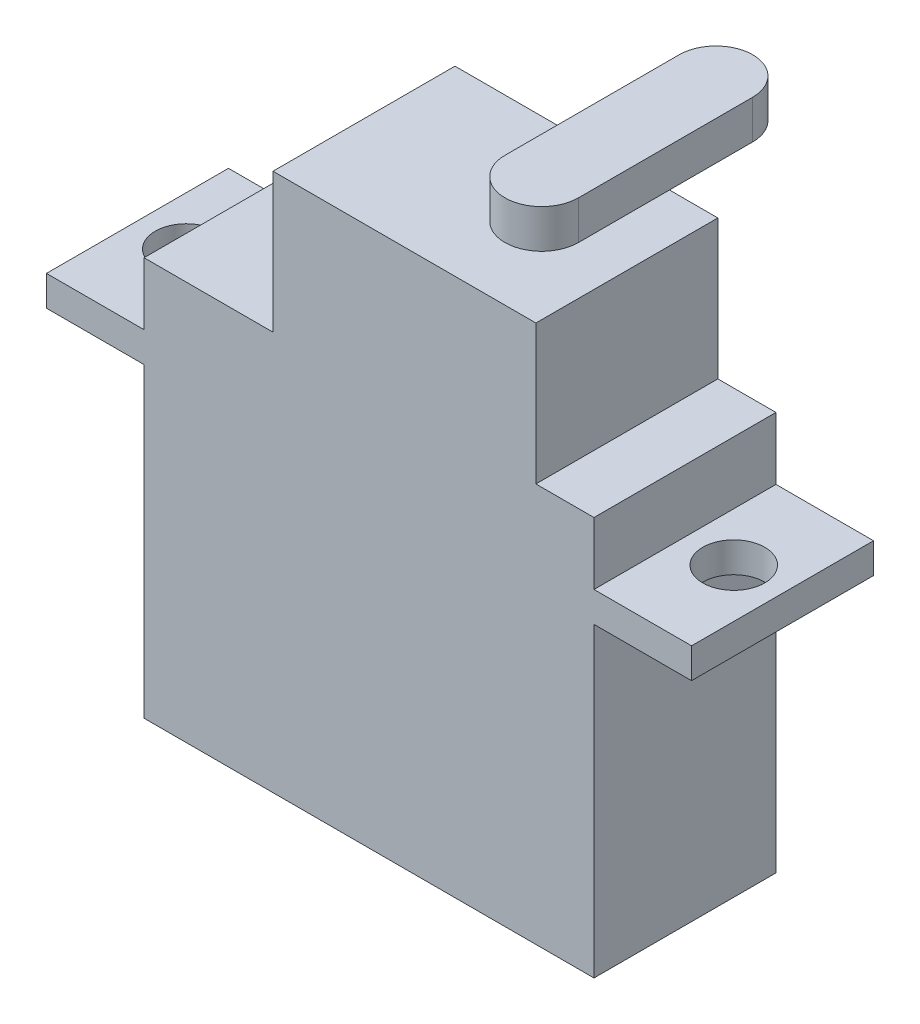
ISO-10303-21;
HEADER;
FILE_DESCRIPTION(('STEP AP214'),'2;1');
FILE_NAME('part.step','',(''),(''),'','','');
FILE_SCHEMA(('AUTOMOTIVE_DESIGN { 1 0 10303 214 1 1 1 1 }'));
ENDSEC;
DATA;
#1=APPLICATION_CONTEXT('core data for automotive mechanical design processes');
#2=APPLICATION_PROTOCOL_DEFINITION('international standard','automotive_design',2000,#1);
#3=PRODUCT_CONTEXT('',#1,'mechanical');
#4=PRODUCT('Part','Part','',(#3));
#5=PRODUCT_RELATED_PRODUCT_CATEGORY('part','',(#4));
#6=PRODUCT_DEFINITION_FORMATION('','',#4);
#7=PRODUCT_DEFINITION_CONTEXT('part definition',#1,'design');
#8=PRODUCT_DEFINITION('design','',#6,#7);
#9=PRODUCT_DEFINITION_SHAPE('','',#8);
#10=(LENGTH_UNIT() NAMED_UNIT(*) SI_UNIT(.MILLI.,.METRE.));
#11=(NAMED_UNIT(*) PLANE_ANGLE_UNIT() SI_UNIT($,.RADIAN.));
#12=(NAMED_UNIT(*) SI_UNIT($,.STERADIAN.) SOLID_ANGLE_UNIT());
#13=UNCERTAINTY_MEASURE_WITH_UNIT(LENGTH_MEASURE(1.E-05),#10,'distance_accuracy_value','');
#14=(GEOMETRIC_REPRESENTATION_CONTEXT(3) GLOBAL_UNCERTAINTY_ASSIGNED_CONTEXT((#13)) GLOBAL_UNIT_ASSIGNED_CONTEXT((#10,
#11,#12)) REPRESENTATION_CONTEXT('',''));
#15=CARTESIAN_POINT('',(0.,0.,0.));
#16=DIRECTION('',(0.,0.,1.));
#17=DIRECTION('',(1.,0.,0.));
#18=AXIS2_PLACEMENT_3D('',#15,#16,#17);
#19=CARTESIAN_POINT('',(0.,26.162,0.));
#20=DIRECTION('',(0.,1.,0.));
#21=DIRECTION('',(0.,0.,1.));
#22=AXIS2_PLACEMENT_3D('',#19,#20,#21);
#23=PLANE('',#22);
#24=DIRECTION('',(0.,0.,1.));
#25=VECTOR('',#24,1.);
#26=CARTESIAN_POINT('',(8.4582,26.162,0.));
#27=LINE('',#26,#25);
#28=CARTESIAN_POINT('',(8.4582,26.162,0.));
#29=VERTEX_POINT('',#28);
#30=CARTESIAN_POINT('',(8.4582,26.162,11.938));
#31=VERTEX_POINT('',#30);
#32=EDGE_CURVE('E197',#29,#31,#27,.T.);
#33=ORIENTED_EDGE('',*,*,#32,.F.);
#34=DIRECTION('',(-1.,0.,0.));
#35=VECTOR('',#34,1.);
#36=CARTESIAN_POINT('',(0.,26.162,0.));
#37=LINE('',#36,#35);
#38=CARTESIAN_POINT('',(0.,26.162,0.));
#39=VERTEX_POINT('',#38);
#40=EDGE_CURVE('E303',#29,#39,#37,.T.);
#41=ORIENTED_EDGE('',*,*,#40,.T.);
#42=DIRECTION('',(0.,0.,1.));
#43=VECTOR('',#42,1.);
#44=CARTESIAN_POINT('',(0.,26.162,0.));
#45=LINE('',#44,#43);
#46=CARTESIAN_POINT('',(0.,26.162,11.938));
#47=VERTEX_POINT('',#46);
#48=EDGE_CURVE('E294',#39,#47,#45,.T.);
#49=ORIENTED_EDGE('',*,*,#48,.T.);
#50=DIRECTION('',(1.,0.,0.));
#51=VECTOR('',#50,1.);
#52=CARTESIAN_POINT('',(0.,26.162,11.938));
#53=LINE('',#52,#51);
#54=EDGE_CURVE('E299',#47,#31,#53,.T.);
#55=ORIENTED_EDGE('',*,*,#54,.T.);
#56=EDGE_LOOP('',(#33,#41,#49,#55));
#57=FACE_BOUND('',#56,.T.);
#58=ADVANCED_FACE('F33',(#57),#23,.T.);
#59=CARTESIAN_POINT('',(0.,26.162,0.));
#60=DIRECTION('',(1.,0.,0.));
#61=DIRECTION('',(0.,0.,-1.));
#62=AXIS2_PLACEMENT_3D('',#59,#60,#61);
#63=PLANE('',#62);
#64=DIRECTION('',(0.,-1.,0.));
#65=VECTOR('',#64,1.);
#66=CARTESIAN_POINT('',(0.,26.162,11.938));
#67=LINE('',#66,#65);
#68=CARTESIAN_POINT('',(0.,20.0914,11.938));
#69=VERTEX_POINT('',#68);
#70=CARTESIAN_POINT('',(0.,0.,11.938));
#71=VERTEX_POINT('',#70);
#72=EDGE_CURVE('E326',#69,#71,#67,.T.);
#73=ORIENTED_EDGE('',*,*,#72,.F.);
#74=DIRECTION('',(0.,0.,-1.));
#75=VECTOR('',#74,1.);
#76=CARTESIAN_POINT('',(0.,20.0914,11.938));
#77=LINE('',#76,#75);
#78=CARTESIAN_POINT('',(0.,20.0914,0.));
#79=VERTEX_POINT('',#78);
#80=EDGE_CURVE('E245',#69,#79,#77,.T.);
#81=ORIENTED_EDGE('',*,*,#80,.T.);
#82=DIRECTION('',(0.,-1.,0.));
#83=VECTOR('',#82,1.);
#84=CARTESIAN_POINT('',(0.,26.162,0.));
#85=LINE('',#84,#83);
#86=CARTESIAN_POINT('',(0.,0.,0.));
#87=VERTEX_POINT('',#86);
#88=EDGE_CURVE('E306',#79,#87,#85,.T.);
#89=ORIENTED_EDGE('',*,*,#88,.T.);
#90=DIRECTION('',(0.,0.,1.));
#91=VECTOR('',#90,1.);
#92=CARTESIAN_POINT('',(0.,0.,0.));
#93=LINE('',#92,#91);
#94=EDGE_CURVE('E293',#87,#71,#93,.T.);
#95=ORIENTED_EDGE('',*,*,#94,.T.);
#96=EDGE_LOOP('',(#73,#81,#89,#95));
#97=FACE_BOUND('',#96,.T.);
#98=ADVANCED_FACE('F341',(#97),#63,.F.);
#99=CARTESIAN_POINT('',(29.5148,26.162,0.));
#100=DIRECTION('',(-1.,0.,0.));
#101=DIRECTION('',(0.,0.,1.));
#102=AXIS2_PLACEMENT_3D('',#99,#100,#101);
#103=PLANE('',#102);
#104=DIRECTION('',(0.,0.,1.));
#105=VECTOR('',#104,1.);
#106=CARTESIAN_POINT('',(29.5148,22.0726,11.938));
#107=LINE('',#106,#105);
#108=CARTESIAN_POINT('',(29.5148,22.0726,0.));
#109=VERTEX_POINT('',#108);
#110=CARTESIAN_POINT('',(29.5148,22.0726,11.938));
#111=VERTEX_POINT('',#110);
#112=EDGE_CURVE('E271',#109,#111,#107,.T.);
#113=ORIENTED_EDGE('',*,*,#112,.F.);
#114=DIRECTION('',(0.,-1.,0.));
#115=VECTOR('',#114,1.);
#116=CARTESIAN_POINT('',(29.5148,26.162,0.));
#117=LINE('',#116,#115);
#118=CARTESIAN_POINT('',(29.5148,26.162,0.));
#119=VERTEX_POINT('',#118);
#120=EDGE_CURVE('E321',#119,#109,#117,.T.);
#121=ORIENTED_EDGE('',*,*,#120,.F.);
#122=DIRECTION('',(0.,0.,-1.));
#123=VECTOR('',#122,1.);
#124=CARTESIAN_POINT('',(29.5148,26.162,0.));
#125=LINE('',#124,#123);
#126=CARTESIAN_POINT('',(29.5148,26.162,11.938));
#127=VERTEX_POINT('',#126);
#128=EDGE_CURVE('E301',#127,#119,#125,.T.);
#129=ORIENTED_EDGE('',*,*,#128,.F.);
#130=DIRECTION('',(0.,-1.,0.));
#131=VECTOR('',#130,1.);
#132=CARTESIAN_POINT('',(29.5148,26.162,11.938));
#133=LINE('',#132,#131);
#134=EDGE_CURVE('E325',#127,#111,#133,.T.);
#135=ORIENTED_EDGE('',*,*,#134,.T.);
#136=EDGE_LOOP('',(#113,#121,#129,#135));
#137=FACE_BOUND('',#136,.T.);
#138=ADVANCED_FACE('F365',(#137),#103,.F.);
#139=DIRECTION('',(0.,0.,-1.));
#140=VECTOR('',#139,1.);
#141=CARTESIAN_POINT('',(29.5148,20.0914,11.938));
#142=LINE('',#141,#140);
#143=CARTESIAN_POINT('',(29.5148,20.0914,11.938));
#144=VERTEX_POINT('',#143);
#145=CARTESIAN_POINT('',(29.5148,20.0914,0.));
#146=VERTEX_POINT('',#145);
#147=EDGE_CURVE('E266',#144,#146,#142,.T.);
#148=ORIENTED_EDGE('',*,*,#147,.F.);
#149=CARTESIAN_POINT('',(29.5148,0.,11.938));
#150=VERTEX_POINT('',#149);
#151=EDGE_CURVE('E324',#144,#150,#133,.T.);
#152=ORIENTED_EDGE('',*,*,#151,.T.);
#153=DIRECTION('',(0.,0.,-1.));
#154=VECTOR('',#153,1.);
#155=CARTESIAN_POINT('',(29.5148,0.,0.));
#156=LINE('',#155,#154);
#157=CARTESIAN_POINT('',(29.5148,0.,0.));
#158=VERTEX_POINT('',#157);
#159=EDGE_CURVE('E312',#150,#158,#156,.T.);
#160=ORIENTED_EDGE('',*,*,#159,.T.);
#161=EDGE_CURVE('E320',#146,#158,#117,.T.);
#162=ORIENTED_EDGE('',*,*,#161,.F.);
#163=EDGE_LOOP('',(#148,#152,#160,#162));
#164=FACE_BOUND('',#163,.T.);
#165=ADVANCED_FACE('F348',(#164),#103,.F.);
#166=CARTESIAN_POINT('',(0.,22.0726,0.));
#167=VERTEX_POINT('',#166);
#168=EDGE_CURVE('E317',#39,#167,#85,.T.);
#169=ORIENTED_EDGE('',*,*,#168,.T.);
#170=DIRECTION('',(0.,0.,1.));
#171=VECTOR('',#170,1.);
#172=CARTESIAN_POINT('',(0.,22.0726,11.938));
#173=LINE('',#172,#171);
#174=CARTESIAN_POINT('',(0.,22.0726,11.938));
#175=VERTEX_POINT('',#174);
#176=EDGE_CURVE('E240',#167,#175,#173,.T.);
#177=ORIENTED_EDGE('',*,*,#176,.T.);
#178=EDGE_CURVE('E42',#47,#175,#67,.T.);
#179=ORIENTED_EDGE('',*,*,#178,.F.);
#180=ORIENTED_EDGE('',*,*,#48,.F.);
#181=EDGE_LOOP('',(#169,#177,#179,#180));
#182=FACE_BOUND('',#181,.T.);
#183=ADVANCED_FACE('F35',(#182),#63,.F.);
#184=CARTESIAN_POINT('',(0.,26.162,11.938));
#185=DIRECTION('',(0.,0.,-1.));
#186=DIRECTION('',(-1.,0.,0.));
#187=AXIS2_PLACEMENT_3D('',#184,#185,#186);
#188=PLANE('',#187);
#189=DIRECTION('',(1.,0.,0.));
#190=VECTOR('',#189,1.);
#191=CARTESIAN_POINT('',(0.,0.,11.938));
#192=LINE('',#191,#190);
#193=EDGE_CURVE('E309',#71,#150,#192,.T.);
#194=ORIENTED_EDGE('',*,*,#193,.T.);
#195=ORIENTED_EDGE('',*,*,#151,.F.);
#196=DIRECTION('',(-1.,0.,0.));
#197=VECTOR('',#196,1.);
#198=CARTESIAN_POINT('',(35.9156,20.0914,11.938));
#199=LINE('',#198,#197);
#200=CARTESIAN_POINT('',(35.9156,20.0914,11.938));
#201=VERTEX_POINT('',#200);
#202=EDGE_CURVE('E290',#201,#144,#199,.T.);
#203=ORIENTED_EDGE('',*,*,#202,.F.);
#204=DIRECTION('',(0.,-1.,0.));
#205=VECTOR('',#204,1.);
#206=CARTESIAN_POINT('',(35.9156,22.0726,11.938));
#207=LINE('',#206,#205);
#208=CARTESIAN_POINT('',(35.9156,22.0726,11.938));
#209=VERTEX_POINT('',#208);
#210=EDGE_CURVE('E267',#209,#201,#207,.T.);
#211=ORIENTED_EDGE('',*,*,#210,.F.);
#212=DIRECTION('',(-1.,0.,0.));
#213=VECTOR('',#212,1.);
#214=CARTESIAN_POINT('',(35.9156,22.0726,11.938));
#215=LINE('',#214,#213);
#216=EDGE_CURVE('E277',#209,#111,#215,.T.);
#217=ORIENTED_EDGE('',*,*,#216,.T.);
#218=ORIENTED_EDGE('',*,*,#134,.F.);
#219=CARTESIAN_POINT('',(25.7048,26.162,11.938));
#220=VERTEX_POINT('',#219);
#221=EDGE_CURVE('E297',#220,#127,#53,.T.);
#222=ORIENTED_EDGE('',*,*,#221,.F.);
#223=DIRECTION('',(0.,-1.,0.));
#224=VECTOR('',#223,1.);
#225=CARTESIAN_POINT('',(25.7048,35.306,11.938));
#226=LINE('',#225,#224);
#227=CARTESIAN_POINT('',(25.7048,35.306,11.938));
#228=VERTEX_POINT('',#227);
#229=EDGE_CURVE('E225',#228,#220,#226,.T.);
#230=ORIENTED_EDGE('',*,*,#229,.F.);
#231=DIRECTION('',(1.,0.,0.));
#232=VECTOR('',#231,1.);
#233=CARTESIAN_POINT('',(8.4582,35.306,11.938));
#234=LINE('',#233,#232);
#235=CARTESIAN_POINT('',(8.4582,35.306,11.938));
#236=VERTEX_POINT('',#235);
#237=EDGE_CURVE('E209',#236,#228,#234,.T.);
#238=ORIENTED_EDGE('',*,*,#237,.F.);
#239=DIRECTION('',(0.,-1.,0.));
#240=VECTOR('',#239,1.);
#241=CARTESIAN_POINT('',(8.4582,35.306,11.938));
#242=LINE('',#241,#240);
#243=EDGE_CURVE('E228',#236,#31,#242,.T.);
#244=ORIENTED_EDGE('',*,*,#243,.T.);
#245=ORIENTED_EDGE('',*,*,#54,.F.);
#246=ORIENTED_EDGE('',*,*,#178,.T.);
#247=DIRECTION('',(1.,0.,0.));
#248=VECTOR('',#247,1.);
#249=CARTESIAN_POINT('',(-6.4008,22.0726,11.938));
#250=LINE('',#249,#248);
#251=CARTESIAN_POINT('',(-6.4008,22.0726,11.938));
#252=VERTEX_POINT('',#251);
#253=EDGE_CURVE('E264',#252,#175,#250,.T.);
#254=ORIENTED_EDGE('',*,*,#253,.F.);
#255=DIRECTION('',(0.,-1.,0.));
#256=VECTOR('',#255,1.);
#257=CARTESIAN_POINT('',(-6.4008,22.0726,11.938));
#258=LINE('',#257,#256);
#259=CARTESIAN_POINT('',(-6.4008,20.0914,11.938));
#260=VERTEX_POINT('',#259);
#261=EDGE_CURVE('E241',#252,#260,#258,.T.);
#262=ORIENTED_EDGE('',*,*,#261,.T.);
#263=DIRECTION('',(1.,0.,0.));
#264=VECTOR('',#263,1.);
#265=CARTESIAN_POINT('',(-6.4008,20.0914,11.938));
#266=LINE('',#265,#264);
#267=EDGE_CURVE('E254',#260,#69,#266,.T.);
#268=ORIENTED_EDGE('',*,*,#267,.T.);
#269=ORIENTED_EDGE('',*,*,#72,.T.);
#270=EDGE_LOOP('',(#194,#195,#203,#211,#217,#218,#222,#230,#238,#244,#245,#246,#254,#262,#268,#269));
#271=FACE_BOUND('',#270,.T.);
#272=ADVANCED_FACE('F332',(#271),#188,.F.);
#273=CARTESIAN_POINT('',(0.,26.162,0.));
#274=DIRECTION('',(0.,0.,1.));
#275=DIRECTION('',(1.,0.,0.));
#276=AXIS2_PLACEMENT_3D('',#273,#274,#275);
#277=PLANE('',#276);
#278=DIRECTION('',(-1.,0.,0.));
#279=VECTOR('',#278,1.);
#280=CARTESIAN_POINT('',(0.,0.,0.));
#281=LINE('',#280,#279);
#282=EDGE_CURVE('E298',#158,#87,#281,.T.);
#283=ORIENTED_EDGE('',*,*,#282,.T.);
#284=ORIENTED_EDGE('',*,*,#88,.F.);
#285=DIRECTION('',(1.,0.,0.));
#286=VECTOR('',#285,1.);
#287=CARTESIAN_POINT('',(-6.4008,20.0914,0.));
#288=LINE('',#287,#286);
#289=CARTESIAN_POINT('',(-6.4008,20.0914,0.));
#290=VERTEX_POINT('',#289);
#291=EDGE_CURVE('E260',#290,#79,#288,.T.);
#292=ORIENTED_EDGE('',*,*,#291,.F.);
#293=DIRECTION('',(0.,1.,0.));
#294=VECTOR('',#293,1.);
#295=CARTESIAN_POINT('',(-6.4008,22.0726,0.));
#296=LINE('',#295,#294);
#297=CARTESIAN_POINT('',(-6.4008,22.0726,0.));
#298=VERTEX_POINT('',#297);
#299=EDGE_CURVE('E248',#290,#298,#296,.T.);
#300=ORIENTED_EDGE('',*,*,#299,.T.);
#301=DIRECTION('',(1.,0.,0.));
#302=VECTOR('',#301,1.);
#303=CARTESIAN_POINT('',(-6.4008,22.0726,0.));
#304=LINE('',#303,#302);
#305=EDGE_CURVE('E262',#298,#167,#304,.T.);
#306=ORIENTED_EDGE('',*,*,#305,.T.);
#307=ORIENTED_EDGE('',*,*,#168,.F.);
#308=ORIENTED_EDGE('',*,*,#40,.F.);
#309=DIRECTION('',(0.,-1.,0.));
#310=VECTOR('',#309,1.);
#311=CARTESIAN_POINT('',(8.4582,35.306,0.));
#312=LINE('',#311,#310);
#313=CARTESIAN_POINT('',(8.4582,35.306,0.));
#314=VERTEX_POINT('',#313);
#315=EDGE_CURVE('E215',#314,#29,#312,.T.);
#316=ORIENTED_EDGE('',*,*,#315,.F.);
#317=DIRECTION('',(-1.,0.,0.));
#318=VECTOR('',#317,1.);
#319=CARTESIAN_POINT('',(8.4582,35.306,0.));
#320=LINE('',#319,#318);
#321=CARTESIAN_POINT('',(17.7038,35.306,0.));
#322=VERTEX_POINT('',#321);
#323=EDGE_CURVE('E213',#322,#314,#320,.T.);
#324=ORIENTED_EDGE('',*,*,#323,.F.);
#325=CARTESIAN_POINT('',(22.5298,35.306,0.));
#326=VERTEX_POINT('',#325);
#327=EDGE_CURVE('E216',#326,#322,#320,.T.);
#328=ORIENTED_EDGE('',*,*,#327,.F.);
#329=CARTESIAN_POINT('',(25.7048,35.306,0.));
#330=VERTEX_POINT('',#329);
#331=EDGE_CURVE('E214',#330,#326,#320,.T.);
#332=ORIENTED_EDGE('',*,*,#331,.F.);
#333=DIRECTION('',(0.,-1.,0.));
#334=VECTOR('',#333,1.);
#335=CARTESIAN_POINT('',(25.7048,35.306,0.));
#336=LINE('',#335,#334);
#337=CARTESIAN_POINT('',(25.7048,26.162,0.));
#338=VERTEX_POINT('',#337);
#339=EDGE_CURVE('E222',#330,#338,#336,.T.);
#340=ORIENTED_EDGE('',*,*,#339,.T.);
#341=EDGE_CURVE('E304',#119,#338,#37,.T.);
#342=ORIENTED_EDGE('',*,*,#341,.F.);
#343=ORIENTED_EDGE('',*,*,#120,.T.);
#344=DIRECTION('',(-1.,0.,0.));
#345=VECTOR('',#344,1.);
#346=CARTESIAN_POINT('',(35.9156,22.0726,0.));
#347=LINE('',#346,#345);
#348=CARTESIAN_POINT('',(35.9156,22.0726,0.));
#349=VERTEX_POINT('',#348);
#350=EDGE_CURVE('E284',#349,#109,#347,.T.);
#351=ORIENTED_EDGE('',*,*,#350,.F.);
#352=DIRECTION('',(0.,1.,0.));
#353=VECTOR('',#352,1.);
#354=CARTESIAN_POINT('',(35.9156,22.0726,0.));
#355=LINE('',#354,#353);
#356=CARTESIAN_POINT('',(35.9156,20.0914,0.));
#357=VERTEX_POINT('',#356);
#358=EDGE_CURVE('E273',#357,#349,#355,.T.);
#359=ORIENTED_EDGE('',*,*,#358,.F.);
#360=DIRECTION('',(-1.,0.,0.));
#361=VECTOR('',#360,1.);
#362=CARTESIAN_POINT('',(35.9156,20.0914,0.));
#363=LINE('',#362,#361);
#364=EDGE_CURVE('E287',#357,#146,#363,.T.);
#365=ORIENTED_EDGE('',*,*,#364,.T.);
#366=ORIENTED_EDGE('',*,*,#161,.T.);
#367=EDGE_LOOP('',(#283,#284,#292,#300,#306,#307,#308,#316,#324,#328,#332,#340,#342,#343,#351,
#359,#365,#366));
#368=FACE_BOUND('',#367,.T.);
#369=ADVANCED_FACE('F344',(#368),#277,.F.);
#370=DIRECTION('',(0.,0.,-1.));
#371=VECTOR('',#370,1.);
#372=CARTESIAN_POINT('',(25.7048,26.162,0.));
#373=LINE('',#372,#371);
#374=EDGE_CURVE('E200',#220,#338,#373,.T.);
#375=ORIENTED_EDGE('',*,*,#374,.F.);
#376=ORIENTED_EDGE('',*,*,#221,.T.);
#377=ORIENTED_EDGE('',*,*,#128,.T.);
#378=ORIENTED_EDGE('',*,*,#341,.T.);
#379=EDGE_LOOP('',(#375,#376,#377,#378));
#380=FACE_BOUND('',#379,.T.);
#381=ADVANCED_FACE('F370',(#380),#23,.T.);
#382=CARTESIAN_POINT('',(0.,0.,0.));
#383=DIRECTION('',(0.,1.,0.));
#384=DIRECTION('',(0.,0.,1.));
#385=AXIS2_PLACEMENT_3D('',#382,#383,#384);
#386=PLANE('',#385);
#387=ORIENTED_EDGE('',*,*,#94,.F.);
#388=ORIENTED_EDGE('',*,*,#282,.F.);
#389=ORIENTED_EDGE('',*,*,#159,.F.);
#390=ORIENTED_EDGE('',*,*,#193,.F.);
#391=EDGE_LOOP('',(#387,#388,#389,#390));
#392=FACE_BOUND('',#391,.T.);
#393=ADVANCED_FACE('F339',(#392),#386,.F.);
#394=CARTESIAN_POINT('',(35.9156,20.0914,11.938));
#395=DIRECTION('',(0.,1.,0.));
#396=DIRECTION('',(0.,0.,1.));
#397=AXIS2_PLACEMENT_3D('',#394,#395,#396);
#398=PLANE('',#397);
#399=CARTESIAN_POINT('',(32.7152,20.0914,5.969));
#400=DIRECTION('',(0.,1.,0.));
#401=DIRECTION('',(0.,0.,1.));
#402=AXIS2_PLACEMENT_3D('',#399,#400,#401);
#403=CIRCLE('',#402,2.032);
#404=CARTESIAN_POINT('',(32.7152,20.0914,8.001));
#405=VERTEX_POINT('',#404);
#406=EDGE_CURVE('E237',#405,#405,#403,.T.);
#407=ORIENTED_EDGE('',*,*,#406,.T.);
#408=EDGE_LOOP('',(#407));
#409=FACE_BOUND('',#408,.T.);
#410=ORIENTED_EDGE('',*,*,#147,.T.);
#411=ORIENTED_EDGE('',*,*,#364,.F.);
#412=DIRECTION('',(0.,0.,-1.));
#413=VECTOR('',#412,1.);
#414=CARTESIAN_POINT('',(35.9156,20.0914,11.938));
#415=LINE('',#414,#413);
#416=EDGE_CURVE('E270',#201,#357,#415,.T.);
#417=ORIENTED_EDGE('',*,*,#416,.F.);
#418=ORIENTED_EDGE('',*,*,#202,.T.);
#419=EDGE_LOOP('',(#410,#411,#417,#418));
#420=FACE_BOUND('',#419,.T.);
#421=ADVANCED_FACE('F352',(#409,#420),#398,.F.);
#422=CARTESIAN_POINT('',(35.9156,22.0726,11.938));
#423=DIRECTION('',(0.,-1.,0.));
#424=DIRECTION('',(0.,0.,-1.));
#425=AXIS2_PLACEMENT_3D('',#422,#423,#424);
#426=PLANE('',#425);
#427=CARTESIAN_POINT('',(32.7152,22.0726,5.969));
#428=DIRECTION('',(0.,1.,0.));
#429=DIRECTION('',(0.,0.,1.));
#430=AXIS2_PLACEMENT_3D('',#427,#428,#429);
#431=CIRCLE('',#430,2.032);
#432=CARTESIAN_POINT('',(32.7152,22.0726,8.001));
#433=VERTEX_POINT('',#432);
#434=EDGE_CURVE('E234',#433,#433,#431,.T.);
#435=ORIENTED_EDGE('',*,*,#434,.F.);
#436=EDGE_LOOP('',(#435));
#437=FACE_BOUND('',#436,.T.);
#438=ORIENTED_EDGE('',*,*,#112,.T.);
#439=ORIENTED_EDGE('',*,*,#216,.F.);
#440=DIRECTION('',(0.,0.,1.));
#441=VECTOR('',#440,1.);
#442=CARTESIAN_POINT('',(35.9156,22.0726,11.938));
#443=LINE('',#442,#441);
#444=EDGE_CURVE('E275',#349,#209,#443,.T.);
#445=ORIENTED_EDGE('',*,*,#444,.F.);
#446=ORIENTED_EDGE('',*,*,#350,.T.);
#447=EDGE_LOOP('',(#438,#439,#445,#446));
#448=FACE_BOUND('',#447,.T.);
#449=ADVANCED_FACE('F361',(#437,#448),#426,.F.);
#450=CARTESIAN_POINT('',(35.9156,0.,0.));
#451=DIRECTION('',(1.,0.,0.));
#452=DIRECTION('',(0.,0.,-1.));
#453=AXIS2_PLACEMENT_3D('',#450,#451,#452);
#454=PLANE('',#453);
#455=ORIENTED_EDGE('',*,*,#210,.T.);
#456=ORIENTED_EDGE('',*,*,#416,.T.);
#457=ORIENTED_EDGE('',*,*,#358,.T.);
#458=ORIENTED_EDGE('',*,*,#444,.T.);
#459=EDGE_LOOP('',(#455,#456,#457,#458));
#460=FACE_BOUND('',#459,.T.);
#461=ADVANCED_FACE('F354',(#460),#454,.T.);
#462=CARTESIAN_POINT('',(-6.4008,22.0726,11.938));
#463=DIRECTION('',(0.,1.,0.));
#464=DIRECTION('',(0.,0.,1.));
#465=AXIS2_PLACEMENT_3D('',#462,#463,#464);
#466=PLANE('',#465);
#467=CARTESIAN_POINT('',(-3.2004,22.0726,5.969));
#468=DIRECTION('',(0.,-1.,0.));
#469=DIRECTION('',(0.,0.,1.));
#470=AXIS2_PLACEMENT_3D('',#467,#468,#469);
#471=CIRCLE('',#470,2.032);
#472=CARTESIAN_POINT('',(-3.2004,22.0726,8.001));
#473=VERTEX_POINT('',#472);
#474=EDGE_CURVE('E231',#473,#473,#471,.T.);
#475=ORIENTED_EDGE('',*,*,#474,.T.);
#476=EDGE_LOOP('',(#475));
#477=FACE_BOUND('',#476,.T.);
#478=ORIENTED_EDGE('',*,*,#176,.F.);
#479=ORIENTED_EDGE('',*,*,#305,.F.);
#480=DIRECTION('',(0.,0.,1.));
#481=VECTOR('',#480,1.);
#482=CARTESIAN_POINT('',(-6.4008,22.0726,11.938));
#483=LINE('',#482,#481);
#484=EDGE_CURVE('E244',#298,#252,#483,.T.);
#485=ORIENTED_EDGE('',*,*,#484,.T.);
#486=ORIENTED_EDGE('',*,*,#253,.T.);
#487=EDGE_LOOP('',(#478,#479,#485,#486));
#488=FACE_BOUND('',#487,.T.);
#489=ADVANCED_FACE('F389',(#477,#488),#466,.T.);
#490=CARTESIAN_POINT('',(-6.4008,20.0914,11.938));
#491=DIRECTION('',(0.,-1.,0.));
#492=DIRECTION('',(0.,0.,-1.));
#493=AXIS2_PLACEMENT_3D('',#490,#491,#492);
#494=PLANE('',#493);
#495=CARTESIAN_POINT('',(-3.2004,20.0914,5.969));
#496=DIRECTION('',(0.,-1.,0.));
#497=DIRECTION('',(0.,0.,-1.));
#498=AXIS2_PLACEMENT_3D('',#495,#496,#497);
#499=CIRCLE('',#498,2.032);
#500=CARTESIAN_POINT('',(-3.2004,20.0914,3.937));
#501=VERTEX_POINT('',#500);
#502=EDGE_CURVE('E37',#501,#501,#499,.F.);
#503=ORIENTED_EDGE('',*,*,#502,.T.);
#504=EDGE_LOOP('',(#503));
#505=FACE_BOUND('',#504,.T.);
#506=ORIENTED_EDGE('',*,*,#80,.F.);
#507=ORIENTED_EDGE('',*,*,#267,.F.);
#508=DIRECTION('',(0.,0.,-1.));
#509=VECTOR('',#508,1.);
#510=CARTESIAN_POINT('',(-6.4008,20.0914,11.938));
#511=LINE('',#510,#509);
#512=EDGE_CURVE('E251',#260,#290,#511,.T.);
#513=ORIENTED_EDGE('',*,*,#512,.T.);
#514=ORIENTED_EDGE('',*,*,#291,.T.);
#515=EDGE_LOOP('',(#506,#507,#513,#514));
#516=FACE_BOUND('',#515,.T.);
#517=ADVANCED_FACE('F397',(#505,#516),#494,.T.);
#518=CARTESIAN_POINT('',(-6.4008,0.,0.));
#519=DIRECTION('',(-1.,0.,0.));
#520=DIRECTION('',(0.,0.,-1.));
#521=AXIS2_PLACEMENT_3D('',#518,#519,#520);
#522=PLANE('',#521);
#523=ORIENTED_EDGE('',*,*,#261,.F.);
#524=ORIENTED_EDGE('',*,*,#484,.F.);
#525=ORIENTED_EDGE('',*,*,#299,.F.);
#526=ORIENTED_EDGE('',*,*,#512,.F.);
#527=EDGE_LOOP('',(#523,#524,#525,#526));
#528=FACE_BOUND('',#527,.T.);
#529=ADVANCED_FACE('F394',(#528),#522,.T.);
#530=CARTESIAN_POINT('',(32.7152,15.6718,5.969));
#531=DIRECTION('',(0.,1.,0.));
#532=DIRECTION('',(0.,0.,1.));
#533=AXIS2_PLACEMENT_3D('',#530,#531,#532);
#534=CYLINDRICAL_SURFACE('',#533,2.032);
#535=ORIENTED_EDGE('',*,*,#434,.T.);
#536=EDGE_LOOP('',(#535));
#537=FACE_BOUND('',#536,.T.);
#538=ORIENTED_EDGE('',*,*,#406,.F.);
#539=EDGE_LOOP('',(#538));
#540=FACE_BOUND('',#539,.T.);
#541=ADVANCED_FACE('F405',(#537,#540),#534,.F.);
#542=CARTESIAN_POINT('',(-3.2004,15.6718,5.969));
#543=DIRECTION('',(0.,1.,0.));
#544=DIRECTION('',(0.,0.,1.));
#545=AXIS2_PLACEMENT_3D('',#542,#543,#544);
#546=CYLINDRICAL_SURFACE('',#545,2.032);
#547=ORIENTED_EDGE('',*,*,#502,.F.);
#548=EDGE_LOOP('',(#547));
#549=FACE_BOUND('',#548,.T.);
#550=ORIENTED_EDGE('',*,*,#474,.F.);
#551=EDGE_LOOP('',(#550));
#552=FACE_BOUND('',#551,.T.);
#553=ADVANCED_FACE('F489',(#549,#552),#546,.F.);
#554=CARTESIAN_POINT('',(8.4582,35.306,0.));
#555=DIRECTION('',(1.,0.,0.));
#556=DIRECTION('',(0.,0.,-1.));
#557=AXIS2_PLACEMENT_3D('',#554,#555,#556);
#558=PLANE('',#557);
#559=ORIENTED_EDGE('',*,*,#32,.T.);
#560=ORIENTED_EDGE('',*,*,#243,.F.);
#561=DIRECTION('',(0.,0.,1.));
#562=VECTOR('',#561,1.);
#563=CARTESIAN_POINT('',(8.4582,35.306,0.));
#564=LINE('',#563,#562);
#565=EDGE_CURVE('E206',#314,#236,#564,.T.);
#566=ORIENTED_EDGE('',*,*,#565,.F.);
#567=ORIENTED_EDGE('',*,*,#315,.T.);
#568=EDGE_LOOP('',(#559,#560,#566,#567));
#569=FACE_BOUND('',#568,.T.);
#570=ADVANCED_FACE('F381',(#569),#558,.F.);
#571=CARTESIAN_POINT('',(25.7048,35.306,0.));
#572=DIRECTION('',(-1.,0.,0.));
#573=DIRECTION('',(0.,0.,1.));
#574=AXIS2_PLACEMENT_3D('',#571,#572,#573);
#575=PLANE('',#574);
#576=ORIENTED_EDGE('',*,*,#374,.T.);
#577=ORIENTED_EDGE('',*,*,#339,.F.);
#578=DIRECTION('',(0.,0.,-1.));
#579=VECTOR('',#578,1.);
#580=CARTESIAN_POINT('',(25.7048,35.306,0.));
#581=LINE('',#580,#579);
#582=EDGE_CURVE('E211',#228,#330,#581,.T.);
#583=ORIENTED_EDGE('',*,*,#582,.F.);
#584=ORIENTED_EDGE('',*,*,#229,.T.);
#585=EDGE_LOOP('',(#576,#577,#583,#584));
#586=FACE_BOUND('',#585,.T.);
#587=ADVANCED_FACE('F372',(#586),#575,.F.);
#588=CARTESIAN_POINT('',(0.,35.306,0.));
#589=DIRECTION('',(0.,1.,0.));
#590=DIRECTION('',(0.,0.,1.));
#591=AXIS2_PLACEMENT_3D('',#588,#589,#590);
#592=PLANE('',#591);
#593=DIRECTION('',(0.,0.,1.));
#594=VECTOR('',#593,1.);
#595=CARTESIAN_POINT('',(17.7038,35.306,5.969));
#596=LINE('',#595,#594);
#597=CARTESIAN_POINT('',(17.7038,35.306,5.969));
#598=VERTEX_POINT('',#597);
#599=EDGE_CURVE('E11',#322,#598,#596,.T.);
#600=ORIENTED_EDGE('',*,*,#599,.F.);
#601=ORIENTED_EDGE('',*,*,#323,.T.);
#602=ORIENTED_EDGE('',*,*,#565,.T.);
#603=ORIENTED_EDGE('',*,*,#237,.T.);
#604=ORIENTED_EDGE('',*,*,#582,.T.);
#605=ORIENTED_EDGE('',*,*,#331,.T.);
#606=DIRECTION('',(0.,0.,-1.));
#607=VECTOR('',#606,1.);
#608=CARTESIAN_POINT('',(22.5298,35.306,5.969));
#609=LINE('',#608,#607);
#610=CARTESIAN_POINT('',(22.5298,35.306,5.969));
#611=VERTEX_POINT('',#610);
#612=EDGE_CURVE('E55',#611,#326,#609,.T.);
#613=ORIENTED_EDGE('',*,*,#612,.F.);
#614=CARTESIAN_POINT('',(20.1168,35.306,5.969));
#615=DIRECTION('',(0.,1.,0.));
#616=DIRECTION('',(0.,0.,1.));
#617=AXIS2_PLACEMENT_3D('',#614,#615,#616);
#618=CIRCLE('',#617,2.413);
#619=EDGE_CURVE('E51',#598,#611,#618,.T.);
#620=ORIENTED_EDGE('',*,*,#619,.F.);
#621=EDGE_LOOP('',(#600,#601,#602,#603,#604,#605,#613,#620));
#622=FACE_BOUND('',#621,.T.);
#623=ADVANCED_FACE('F377',(#622),#592,.T.);
#624=CARTESIAN_POINT('',(20.1168,35.306,5.969));
#625=DIRECTION('',(0.,1.,0.));
#626=DIRECTION('',(0.,0.,1.));
#627=AXIS2_PLACEMENT_3D('',#624,#625,#626);
#628=PLANE('',#627);
#629=CARTESIAN_POINT('',(22.5298,35.306,-5.461));
#630=VERTEX_POINT('',#629);
#631=EDGE_CURVE('E600',#326,#630,#609,.T.);
#632=ORIENTED_EDGE('',*,*,#631,.F.);
#633=ORIENTED_EDGE('',*,*,#327,.T.);
#634=CARTESIAN_POINT('',(17.7038,35.306,-5.461));
#635=VERTEX_POINT('',#634);
#636=EDGE_CURVE('E44',#635,#322,#596,.T.);
#637=ORIENTED_EDGE('',*,*,#636,.F.);
#638=CARTESIAN_POINT('',(20.1168,35.306,-5.461));
#639=DIRECTION('',(0.,1.,0.));
#640=DIRECTION('',(0.,0.,1.));
#641=AXIS2_PLACEMENT_3D('',#638,#639,#640);
#642=CIRCLE('',#641,2.41299999999999);
#643=EDGE_CURVE('E592',#630,#635,#642,.T.);
#644=ORIENTED_EDGE('',*,*,#643,.F.);
#645=EDGE_LOOP('',(#632,#633,#637,#644));
#646=FACE_BOUND('',#645,.T.);
#647=ADVANCED_FACE('F524',(#646),#628,.F.);
#648=CARTESIAN_POINT('',(20.1168,37.846,5.969));
#649=DIRECTION('',(0.,-1.,0.));
#650=DIRECTION('',(0.,0.,-1.));
#651=AXIS2_PLACEMENT_3D('',#648,#649,#650);
#652=CYLINDRICAL_SURFACE('',#651,2.413);
#653=ORIENTED_EDGE('',*,*,#619,.T.);
#654=DIRECTION('',(0.,-1.,0.));
#655=VECTOR('',#654,1.);
#656=CARTESIAN_POINT('',(22.5298,37.846,5.969));
#657=LINE('',#656,#655);
#658=CARTESIAN_POINT('',(22.5298,37.846,5.969));
#659=VERTEX_POINT('',#658);
#660=EDGE_CURVE('E180',#659,#611,#657,.T.);
#661=ORIENTED_EDGE('',*,*,#660,.F.);
#662=CARTESIAN_POINT('',(20.1168,37.846,5.969));
#663=DIRECTION('',(0.,1.,0.));
#664=DIRECTION('',(0.,0.,1.));
#665=AXIS2_PLACEMENT_3D('',#662,#663,#664);
#666=CIRCLE('',#665,2.413);
#667=CARTESIAN_POINT('',(17.7038,37.846,5.969));
#668=VERTEX_POINT('',#667);
#669=EDGE_CURVE('E186',#668,#659,#666,.T.);
#670=ORIENTED_EDGE('',*,*,#669,.F.);
#671=DIRECTION('',(0.,-1.,0.));
#672=VECTOR('',#671,1.);
#673=CARTESIAN_POINT('',(17.7038,37.846,5.969));
#674=LINE('',#673,#672);
#675=EDGE_CURVE('E596',#668,#598,#674,.T.);
#676=ORIENTED_EDGE('',*,*,#675,.T.);
#677=EDGE_LOOP('',(#653,#661,#670,#676));
#678=FACE_BOUND('',#677,.T.);
#679=ADVANCED_FACE('F196',(#678),#652,.T.);
#680=CARTESIAN_POINT('',(22.5298,37.846,5.969));
#681=DIRECTION('',(-1.,0.,0.));
#682=DIRECTION('',(0.,0.,1.));
#683=AXIS2_PLACEMENT_3D('',#680,#681,#682);
#684=PLANE('',#683);
#685=ORIENTED_EDGE('',*,*,#612,.T.);
#686=ORIENTED_EDGE('',*,*,#631,.T.);
#687=DIRECTION('',(0.,-1.,0.));
#688=VECTOR('',#687,1.);
#689=CARTESIAN_POINT('',(22.5298,37.846,-5.461));
#690=LINE('',#689,#688);
#691=CARTESIAN_POINT('',(22.5298,37.846,-5.461));
#692=VERTEX_POINT('',#691);
#693=EDGE_CURVE('E182',#692,#630,#690,.T.);
#694=ORIENTED_EDGE('',*,*,#693,.F.);
#695=DIRECTION('',(0.,0.,-1.));
#696=VECTOR('',#695,1.);
#697=CARTESIAN_POINT('',(22.5298,37.846,5.969));
#698=LINE('',#697,#696);
#699=EDGE_CURVE('E176',#659,#692,#698,.T.);
#700=ORIENTED_EDGE('',*,*,#699,.F.);
#701=ORIENTED_EDGE('',*,*,#660,.T.);
#702=EDGE_LOOP('',(#685,#686,#694,#700,#701));
#703=FACE_BOUND('',#702,.T.);
#704=ADVANCED_FACE('F178',(#703),#684,.F.);
#705=CARTESIAN_POINT('',(20.1168,37.846,-5.461));
#706=DIRECTION('',(0.,-1.,0.));
#707=DIRECTION('',(0.,0.,-1.));
#708=AXIS2_PLACEMENT_3D('',#705,#706,#707);
#709=CYLINDRICAL_SURFACE('',#708,2.41299999999999);
#710=ORIENTED_EDGE('',*,*,#643,.T.);
#711=DIRECTION('',(0.,-1.,0.));
#712=VECTOR('',#711,1.);
#713=CARTESIAN_POINT('',(17.7038,37.846,-5.461));
#714=LINE('',#713,#712);
#715=CARTESIAN_POINT('',(17.7038,37.846,-5.461));
#716=VERTEX_POINT('',#715);
#717=EDGE_CURVE('E202',#716,#635,#714,.T.);
#718=ORIENTED_EDGE('',*,*,#717,.F.);
#719=CARTESIAN_POINT('',(20.1168,37.846,-5.461));
#720=DIRECTION('',(0.,1.,0.));
#721=DIRECTION('',(0.,0.,1.));
#722=AXIS2_PLACEMENT_3D('',#719,#720,#721);
#723=CIRCLE('',#722,2.41299999999999);
#724=EDGE_CURVE('E185',#692,#716,#723,.T.);
#725=ORIENTED_EDGE('',*,*,#724,.F.);
#726=ORIENTED_EDGE('',*,*,#693,.T.);
#727=EDGE_LOOP('',(#710,#718,#725,#726));
#728=FACE_BOUND('',#727,.T.);
#729=ADVANCED_FACE('F545',(#728),#709,.T.);
#730=CARTESIAN_POINT('',(17.7038,37.846,5.969));
#731=DIRECTION('',(1.,0.,0.));
#732=DIRECTION('',(0.,0.,-1.));
#733=AXIS2_PLACEMENT_3D('',#730,#731,#732);
#734=PLANE('',#733);
#735=ORIENTED_EDGE('',*,*,#636,.T.);
#736=ORIENTED_EDGE('',*,*,#599,.T.);
#737=ORIENTED_EDGE('',*,*,#675,.F.);
#738=DIRECTION('',(0.,0.,1.));
#739=VECTOR('',#738,1.);
#740=CARTESIAN_POINT('',(17.7038,37.846,5.969));
#741=LINE('',#740,#739);
#742=EDGE_CURVE('E191',#716,#668,#741,.T.);
#743=ORIENTED_EDGE('',*,*,#742,.F.);
#744=ORIENTED_EDGE('',*,*,#717,.T.);
#745=EDGE_LOOP('',(#735,#736,#737,#743,#744));
#746=FACE_BOUND('',#745,.T.);
#747=ADVANCED_FACE('F552',(#746),#734,.F.);
#748=CARTESIAN_POINT('',(20.1168,37.846,5.969));
#749=DIRECTION('',(0.,1.,0.));
#750=DIRECTION('',(0.,0.,1.));
#751=AXIS2_PLACEMENT_3D('',#748,#749,#750);
#752=PLANE('',#751);
#753=ORIENTED_EDGE('',*,*,#669,.T.);
#754=ORIENTED_EDGE('',*,*,#699,.T.);
#755=ORIENTED_EDGE('',*,*,#724,.T.);
#756=ORIENTED_EDGE('',*,*,#742,.T.);
#757=EDGE_LOOP('',(#753,#754,#755,#756));
#758=FACE_BOUND('',#757,.T.);
#759=ADVANCED_FACE('F189',(#758),#752,.T.);
#760=CLOSED_SHELL('',(#58,#98,#138,#165,#183,#272,#369,#381,#393,#421,#449,#461,#489,#517,#529,
#541,#553,#570,#587,#623,#647,#679,#704,#729,#747,#759));
#761=MANIFOLD_SOLID_BREP('B2',#760);
#762=ADVANCED_BREP_SHAPE_REPRESENTATION('',(#18,#761),#14);
#763=SHAPE_DEFINITION_REPRESENTATION(#9,#762);
ENDSEC;
END-ISO-10303-21;
